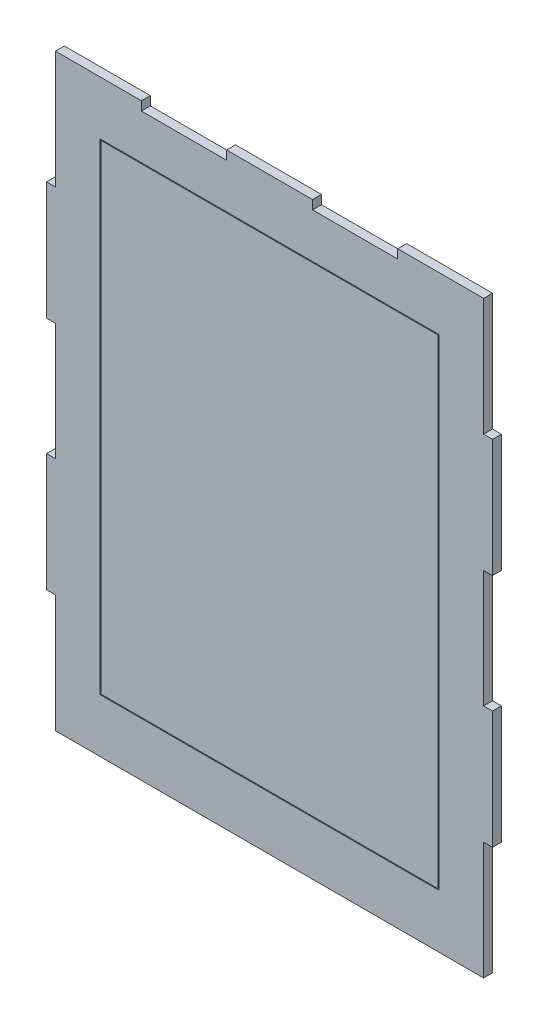
ISO-10303-21;
HEADER;
FILE_DESCRIPTION(('STEP AP214'),'2;1');
FILE_NAME('part.step','',(''),(''),'','','');
FILE_SCHEMA(('AUTOMOTIVE_DESIGN { 1 0 10303 214 1 1 1 1 }'));
ENDSEC;
DATA;
#1=APPLICATION_CONTEXT('core data for automotive mechanical design processes');
#2=APPLICATION_PROTOCOL_DEFINITION('international standard','automotive_design',2000,#1);
#3=PRODUCT_CONTEXT('',#1,'mechanical');
#4=PRODUCT('Part','Part','',(#3));
#5=PRODUCT_RELATED_PRODUCT_CATEGORY('part','',(#4));
#6=PRODUCT_DEFINITION_FORMATION('','',#4);
#7=PRODUCT_DEFINITION_CONTEXT('part definition',#1,'design');
#8=PRODUCT_DEFINITION('design','',#6,#7);
#9=PRODUCT_DEFINITION_SHAPE('','',#8);
#10=(LENGTH_UNIT() NAMED_UNIT(*) SI_UNIT(.MILLI.,.METRE.));
#11=(NAMED_UNIT(*) PLANE_ANGLE_UNIT() SI_UNIT($,.RADIAN.));
#12=(NAMED_UNIT(*) SI_UNIT($,.STERADIAN.) SOLID_ANGLE_UNIT());
#13=UNCERTAINTY_MEASURE_WITH_UNIT(LENGTH_MEASURE(1.E-05),#10,'distance_accuracy_value','');
#14=(GEOMETRIC_REPRESENTATION_CONTEXT(3) GLOBAL_UNCERTAINTY_ASSIGNED_CONTEXT((#13)) GLOBAL_UNIT_ASSIGNED_CONTEXT((#10,
#11,#12)) REPRESENTATION_CONTEXT('',''));
#15=CARTESIAN_POINT('',(0.,0.,0.));
#16=DIRECTION('',(0.,0.,1.));
#17=DIRECTION('',(1.,0.,0.));
#18=AXIS2_PLACEMENT_3D('',#15,#16,#17);
#19=CARTESIAN_POINT('',(0.,30.,5.));
#20=DIRECTION('',(0.,-1.,0.));
#21=DIRECTION('',(1.,0.,0.));
#22=AXIS2_PLACEMENT_3D('',#19,#20,#21);
#23=PLANE('',#22);
#24=DIRECTION('',(-1.,0.,0.));
#25=VECTOR('',#24,1.);
#26=CARTESIAN_POINT('',(0.,30.,0.));
#27=LINE('',#26,#25);
#28=CARTESIAN_POINT('',(220.,30.,0.));
#29=VERTEX_POINT('',#28);
#30=CARTESIAN_POINT('',(30.,30.,0.));
#31=VERTEX_POINT('',#30);
#32=EDGE_CURVE('E463',#29,#31,#27,.T.);
#33=ORIENTED_EDGE('',*,*,#32,.T.);
#34=DIRECTION('',(0.,0.,-1.));
#35=VECTOR('',#34,1.);
#36=CARTESIAN_POINT('',(30.,30.,5.));
#37=LINE('',#36,#35);
#38=CARTESIAN_POINT('',(30.,30.,5.));
#39=VERTEX_POINT('',#38);
#40=EDGE_CURVE('E13',#39,#31,#37,.T.);
#41=ORIENTED_EDGE('',*,*,#40,.F.);
#42=DIRECTION('',(-1.,0.,0.));
#43=VECTOR('',#42,1.);
#44=CARTESIAN_POINT('',(0.,30.,5.));
#45=LINE('',#44,#43);
#46=CARTESIAN_POINT('',(220.,30.,5.));
#47=VERTEX_POINT('',#46);
#48=EDGE_CURVE('E370',#47,#39,#45,.T.);
#49=ORIENTED_EDGE('',*,*,#48,.F.);
#50=DIRECTION('',(0.,0.,-1.));
#51=VECTOR('',#50,1.);
#52=CARTESIAN_POINT('',(220.,30.,5.));
#53=LINE('',#52,#51);
#54=EDGE_CURVE('E470',#47,#29,#53,.T.);
#55=ORIENTED_EDGE('',*,*,#54,.T.);
#56=EDGE_LOOP('',(#33,#41,#49,#55));
#57=FACE_BOUND('',#56,.T.);
#58=ADVANCED_FACE('F145',(#57),#23,.F.);
#59=CARTESIAN_POINT('',(30.,0.,5.));
#60=DIRECTION('',(-1.,0.,0.));
#61=DIRECTION('',(0.,-1.,0.));
#62=AXIS2_PLACEMENT_3D('',#59,#60,#61);
#63=PLANE('',#62);
#64=DIRECTION('',(0.,1.,0.));
#65=VECTOR('',#64,1.);
#66=CARTESIAN_POINT('',(30.,0.,0.));
#67=LINE('',#66,#65);
#68=CARTESIAN_POINT('',(30.,300.,0.));
#69=VERTEX_POINT('',#68);
#70=EDGE_CURVE('E375',#31,#69,#67,.T.);
#71=ORIENTED_EDGE('',*,*,#70,.T.);
#72=DIRECTION('',(0.,0.,-1.));
#73=VECTOR('',#72,1.);
#74=CARTESIAN_POINT('',(30.,300.,5.));
#75=LINE('',#74,#73);
#76=CARTESIAN_POINT('',(30.,300.,5.));
#77=VERTEX_POINT('',#76);
#78=EDGE_CURVE('E155',#77,#69,#75,.T.);
#79=ORIENTED_EDGE('',*,*,#78,.F.);
#80=DIRECTION('',(0.,1.,0.));
#81=VECTOR('',#80,1.);
#82=CARTESIAN_POINT('',(30.,0.,5.));
#83=LINE('',#82,#81);
#84=EDGE_CURVE('E364',#39,#77,#83,.T.);
#85=ORIENTED_EDGE('',*,*,#84,.F.);
#86=ORIENTED_EDGE('',*,*,#40,.T.);
#87=EDGE_LOOP('',(#71,#79,#85,#86));
#88=FACE_BOUND('',#87,.T.);
#89=ADVANCED_FACE('F374',(#88),#63,.F.);
#90=CARTESIAN_POINT('',(0.,300.,5.));
#91=DIRECTION('',(0.,1.,0.));
#92=DIRECTION('',(0.,0.,1.));
#93=AXIS2_PLACEMENT_3D('',#90,#91,#92);
#94=PLANE('',#93);
#95=DIRECTION('',(1.,0.,0.));
#96=VECTOR('',#95,1.);
#97=CARTESIAN_POINT('',(0.,300.,0.));
#98=LINE('',#97,#96);
#99=CARTESIAN_POINT('',(220.,300.,0.));
#100=VERTEX_POINT('',#99);
#101=EDGE_CURVE('E265',#69,#100,#98,.T.);
#102=ORIENTED_EDGE('',*,*,#101,.T.);
#103=DIRECTION('',(0.,0.,-1.));
#104=VECTOR('',#103,1.);
#105=CARTESIAN_POINT('',(220.,300.,5.));
#106=LINE('',#105,#104);
#107=CARTESIAN_POINT('',(220.,300.,5.));
#108=VERTEX_POINT('',#107);
#109=EDGE_CURVE('E376',#108,#100,#106,.T.);
#110=ORIENTED_EDGE('',*,*,#109,.F.);
#111=DIRECTION('',(1.,0.,0.));
#112=VECTOR('',#111,1.);
#113=CARTESIAN_POINT('',(0.,300.,5.));
#114=LINE('',#113,#112);
#115=EDGE_CURVE('E368',#77,#108,#114,.T.);
#116=ORIENTED_EDGE('',*,*,#115,.F.);
#117=ORIENTED_EDGE('',*,*,#78,.T.);
#118=EDGE_LOOP('',(#102,#110,#116,#117));
#119=FACE_BOUND('',#118,.T.);
#120=ADVANCED_FACE('F378',(#119),#94,.F.);
#121=CARTESIAN_POINT('',(196.9,0.,5.));
#122=DIRECTION('',(-1.,0.,0.));
#123=DIRECTION('',(0.,0.,1.));
#124=AXIS2_PLACEMENT_3D('',#121,#122,#123);
#125=PLANE('',#124);
#126=DIRECTION('',(0.,1.,0.));
#127=VECTOR('',#126,1.);
#128=CARTESIAN_POINT('',(196.9,0.,0.));
#129=LINE('',#128,#127);
#130=CARTESIAN_POINT('',(196.9,325.1,0.));
#131=VERTEX_POINT('',#130);
#132=CARTESIAN_POINT('',(196.9,330.1,0.));
#133=VERTEX_POINT('',#132);
#134=EDGE_CURVE('E384',#131,#133,#129,.T.);
#135=ORIENTED_EDGE('',*,*,#134,.F.);
#136=DIRECTION('',(0.,0.,-1.));
#137=VECTOR('',#136,1.);
#138=CARTESIAN_POINT('',(196.9,325.1,5.));
#139=LINE('',#138,#137);
#140=CARTESIAN_POINT('',(196.9,325.1,5.));
#141=VERTEX_POINT('',#140);
#142=EDGE_CURVE('E149',#141,#131,#139,.T.);
#143=ORIENTED_EDGE('',*,*,#142,.F.);
#144=DIRECTION('',(0.,1.,0.));
#145=VECTOR('',#144,1.);
#146=CARTESIAN_POINT('',(196.9,0.,5.));
#147=LINE('',#146,#145);
#148=CARTESIAN_POINT('',(196.9,330.1,5.));
#149=VERTEX_POINT('',#148);
#150=EDGE_CURVE('E469',#141,#149,#147,.T.);
#151=ORIENTED_EDGE('',*,*,#150,.T.);
#152=DIRECTION('',(0.,0.,-1.));
#153=VECTOR('',#152,1.);
#154=CARTESIAN_POINT('',(196.9,330.1,5.));
#155=LINE('',#154,#153);
#156=EDGE_CURVE('E380',#149,#133,#155,.T.);
#157=ORIENTED_EDGE('',*,*,#156,.T.);
#158=EDGE_LOOP('',(#135,#143,#151,#157));
#159=FACE_BOUND('',#158,.T.);
#160=ADVANCED_FACE('F147',(#159),#125,.T.);
#161=CARTESIAN_POINT('',(0.,325.1,5.));
#162=DIRECTION('',(0.,1.,0.));
#163=DIRECTION('',(0.,0.,1.));
#164=AXIS2_PLACEMENT_3D('',#161,#162,#163);
#165=PLANE('',#164);
#166=DIRECTION('',(1.,0.,0.));
#167=VECTOR('',#166,1.);
#168=CARTESIAN_POINT('',(0.,325.1,0.));
#169=LINE('',#168,#167);
#170=CARTESIAN_POINT('',(149.1,325.1,0.));
#171=VERTEX_POINT('',#170);
#172=EDGE_CURVE('E387',#171,#131,#169,.T.);
#173=ORIENTED_EDGE('',*,*,#172,.F.);
#174=DIRECTION('',(0.,0.,-1.));
#175=VECTOR('',#174,1.);
#176=CARTESIAN_POINT('',(149.1,325.1,5.));
#177=LINE('',#176,#175);
#178=CARTESIAN_POINT('',(149.1,325.1,5.));
#179=VERTEX_POINT('',#178);
#180=EDGE_CURVE('E528',#179,#171,#177,.T.);
#181=ORIENTED_EDGE('',*,*,#180,.F.);
#182=DIRECTION('',(1.,0.,0.));
#183=VECTOR('',#182,1.);
#184=CARTESIAN_POINT('',(0.,325.1,5.));
#185=LINE('',#184,#183);
#186=EDGE_CURVE('E537',#179,#141,#185,.T.);
#187=ORIENTED_EDGE('',*,*,#186,.T.);
#188=ORIENTED_EDGE('',*,*,#142,.T.);
#189=EDGE_LOOP('',(#173,#181,#187,#188));
#190=FACE_BOUND('',#189,.T.);
#191=ADVANCED_FACE('F535',(#190),#165,.T.);
#192=CARTESIAN_POINT('',(149.1,0.,5.));
#193=DIRECTION('',(1.,0.,0.));
#194=DIRECTION('',(0.,0.,-1.));
#195=AXIS2_PLACEMENT_3D('',#192,#193,#194);
#196=PLANE('',#195);
#197=DIRECTION('',(0.,-1.,0.));
#198=VECTOR('',#197,1.);
#199=CARTESIAN_POINT('',(149.1,0.,0.));
#200=LINE('',#199,#198);
#201=CARTESIAN_POINT('',(149.1,330.1,0.));
#202=VERTEX_POINT('',#201);
#203=EDGE_CURVE('E390',#202,#171,#200,.T.);
#204=ORIENTED_EDGE('',*,*,#203,.F.);
#205=DIRECTION('',(0.,0.,-1.));
#206=VECTOR('',#205,1.);
#207=CARTESIAN_POINT('',(149.1,330.1,5.));
#208=LINE('',#207,#206);
#209=CARTESIAN_POINT('',(149.1,330.1,5.));
#210=VERTEX_POINT('',#209);
#211=EDGE_CURVE('E527',#210,#202,#208,.T.);
#212=ORIENTED_EDGE('',*,*,#211,.F.);
#213=DIRECTION('',(0.,-1.,0.));
#214=VECTOR('',#213,1.);
#215=CARTESIAN_POINT('',(149.1,0.,5.));
#216=LINE('',#215,#214);
#217=EDGE_CURVE('E545',#210,#179,#216,.T.);
#218=ORIENTED_EDGE('',*,*,#217,.T.);
#219=ORIENTED_EDGE('',*,*,#180,.T.);
#220=EDGE_LOOP('',(#204,#212,#218,#219));
#221=FACE_BOUND('',#220,.T.);
#222=ADVANCED_FACE('F543',(#221),#196,.T.);
#223=CARTESIAN_POINT('',(0.,330.1,5.));
#224=DIRECTION('',(0.,1.,0.));
#225=DIRECTION('',(0.,0.,1.));
#226=AXIS2_PLACEMENT_3D('',#223,#224,#225);
#227=PLANE('',#226);
#228=DIRECTION('',(1.,0.,0.));
#229=VECTOR('',#228,1.);
#230=CARTESIAN_POINT('',(0.,330.1,0.));
#231=LINE('',#230,#229);
#232=CARTESIAN_POINT('',(100.9,330.1,0.));
#233=VERTEX_POINT('',#232);
#234=EDGE_CURVE('E393',#233,#202,#231,.T.);
#235=ORIENTED_EDGE('',*,*,#234,.F.);
#236=DIRECTION('',(0.,0.,-1.));
#237=VECTOR('',#236,1.);
#238=CARTESIAN_POINT('',(100.9,330.1,5.));
#239=LINE('',#238,#237);
#240=CARTESIAN_POINT('',(100.9,330.1,5.));
#241=VERTEX_POINT('',#240);
#242=EDGE_CURVE('E525',#241,#233,#239,.T.);
#243=ORIENTED_EDGE('',*,*,#242,.F.);
#244=DIRECTION('',(1.,0.,0.));
#245=VECTOR('',#244,1.);
#246=CARTESIAN_POINT('',(0.,330.1,5.));
#247=LINE('',#246,#245);
#248=EDGE_CURVE('E551',#241,#210,#247,.T.);
#249=ORIENTED_EDGE('',*,*,#248,.T.);
#250=ORIENTED_EDGE('',*,*,#211,.T.);
#251=EDGE_LOOP('',(#235,#243,#249,#250));
#252=FACE_BOUND('',#251,.T.);
#253=ADVANCED_FACE('F554',(#252),#227,.T.);
#254=CARTESIAN_POINT('',(100.9,0.,5.));
#255=DIRECTION('',(-1.,0.,0.));
#256=DIRECTION('',(0.,0.,1.));
#257=AXIS2_PLACEMENT_3D('',#254,#255,#256);
#258=PLANE('',#257);
#259=DIRECTION('',(0.,1.,0.));
#260=VECTOR('',#259,1.);
#261=CARTESIAN_POINT('',(100.9,0.,0.));
#262=LINE('',#261,#260);
#263=CARTESIAN_POINT('',(100.9,325.1,0.));
#264=VERTEX_POINT('',#263);
#265=EDGE_CURVE('E396',#264,#233,#262,.T.);
#266=ORIENTED_EDGE('',*,*,#265,.F.);
#267=DIRECTION('',(0.,0.,-1.));
#268=VECTOR('',#267,1.);
#269=CARTESIAN_POINT('',(100.9,325.1,5.));
#270=LINE('',#269,#268);
#271=CARTESIAN_POINT('',(100.9,325.1,5.));
#272=VERTEX_POINT('',#271);
#273=EDGE_CURVE('E523',#272,#264,#270,.T.);
#274=ORIENTED_EDGE('',*,*,#273,.F.);
#275=DIRECTION('',(0.,1.,0.));
#276=VECTOR('',#275,1.);
#277=CARTESIAN_POINT('',(100.9,0.,5.));
#278=LINE('',#277,#276);
#279=EDGE_CURVE('E555',#272,#241,#278,.T.);
#280=ORIENTED_EDGE('',*,*,#279,.T.);
#281=ORIENTED_EDGE('',*,*,#242,.T.);
#282=EDGE_LOOP('',(#266,#274,#280,#281));
#283=FACE_BOUND('',#282,.T.);
#284=ADVANCED_FACE('F721',(#283),#258,.T.);
#285=CARTESIAN_POINT('',(0.,325.1,5.));
#286=DIRECTION('',(0.,1.,0.));
#287=DIRECTION('',(0.,0.,1.));
#288=AXIS2_PLACEMENT_3D('',#285,#286,#287);
#289=PLANE('',#288);
#290=DIRECTION('',(1.,0.,0.));
#291=VECTOR('',#290,1.);
#292=CARTESIAN_POINT('',(0.,325.1,0.));
#293=LINE('',#292,#291);
#294=CARTESIAN_POINT('',(53.0999999999999,325.1,0.));
#295=VERTEX_POINT('',#294);
#296=EDGE_CURVE('E399',#295,#264,#293,.T.);
#297=ORIENTED_EDGE('',*,*,#296,.F.);
#298=DIRECTION('',(0.,0.,-1.));
#299=VECTOR('',#298,1.);
#300=CARTESIAN_POINT('',(53.0999999999999,325.1,5.));
#301=LINE('',#300,#299);
#302=CARTESIAN_POINT('',(53.0999999999999,325.1,5.));
#303=VERTEX_POINT('',#302);
#304=EDGE_CURVE('E521',#303,#295,#301,.T.);
#305=ORIENTED_EDGE('',*,*,#304,.F.);
#306=DIRECTION('',(1.,0.,0.));
#307=VECTOR('',#306,1.);
#308=CARTESIAN_POINT('',(0.,325.1,5.));
#309=LINE('',#308,#307);
#310=EDGE_CURVE('E557',#303,#272,#309,.T.);
#311=ORIENTED_EDGE('',*,*,#310,.T.);
#312=ORIENTED_EDGE('',*,*,#273,.T.);
#313=EDGE_LOOP('',(#297,#305,#311,#312));
#314=FACE_BOUND('',#313,.T.);
#315=ADVANCED_FACE('F718',(#314),#289,.T.);
#316=CARTESIAN_POINT('',(53.0999999999999,0.,5.));
#317=DIRECTION('',(1.,0.,0.));
#318=DIRECTION('',(0.,0.,-1.));
#319=AXIS2_PLACEMENT_3D('',#316,#317,#318);
#320=PLANE('',#319);
#321=DIRECTION('',(0.,-1.,0.));
#322=VECTOR('',#321,1.);
#323=CARTESIAN_POINT('',(53.0999999999999,0.,0.));
#324=LINE('',#323,#322);
#325=CARTESIAN_POINT('',(53.0999999999999,330.1,0.));
#326=VERTEX_POINT('',#325);
#327=EDGE_CURVE('E402',#326,#295,#324,.T.);
#328=ORIENTED_EDGE('',*,*,#327,.F.);
#329=DIRECTION('',(0.,0.,-1.));
#330=VECTOR('',#329,1.);
#331=CARTESIAN_POINT('',(53.0999999999999,330.1,5.));
#332=LINE('',#331,#330);
#333=CARTESIAN_POINT('',(53.0999999999999,330.1,5.));
#334=VERTEX_POINT('',#333);
#335=EDGE_CURVE('E519',#334,#326,#332,.T.);
#336=ORIENTED_EDGE('',*,*,#335,.F.);
#337=DIRECTION('',(0.,-1.,0.));
#338=VECTOR('',#337,1.);
#339=CARTESIAN_POINT('',(53.0999999999999,0.,5.));
#340=LINE('',#339,#338);
#341=EDGE_CURVE('E563',#334,#303,#340,.T.);
#342=ORIENTED_EDGE('',*,*,#341,.T.);
#343=ORIENTED_EDGE('',*,*,#304,.T.);
#344=EDGE_LOOP('',(#328,#336,#342,#343));
#345=FACE_BOUND('',#344,.T.);
#346=ADVANCED_FACE('F714',(#345),#320,.T.);
#347=CARTESIAN_POINT('',(0.,330.1,5.));
#348=DIRECTION('',(0.,1.,0.));
#349=DIRECTION('',(0.,0.,1.));
#350=AXIS2_PLACEMENT_3D('',#347,#348,#349);
#351=PLANE('',#350);
#352=DIRECTION('',(1.,0.,0.));
#353=VECTOR('',#352,1.);
#354=CARTESIAN_POINT('',(0.,330.1,0.));
#355=LINE('',#354,#353);
#356=CARTESIAN_POINT('',(4.9,330.1,0.));
#357=VERTEX_POINT('',#356);
#358=EDGE_CURVE('E405',#357,#326,#355,.T.);
#359=ORIENTED_EDGE('',*,*,#358,.F.);
#360=DIRECTION('',(0.,0.,-1.));
#361=VECTOR('',#360,1.);
#362=CARTESIAN_POINT('',(4.9,330.1,5.));
#363=LINE('',#362,#361);
#364=CARTESIAN_POINT('',(4.9,330.1,5.));
#365=VERTEX_POINT('',#364);
#366=EDGE_CURVE('E517',#365,#357,#363,.T.);
#367=ORIENTED_EDGE('',*,*,#366,.F.);
#368=DIRECTION('',(1.,0.,0.));
#369=VECTOR('',#368,1.);
#370=CARTESIAN_POINT('',(0.,330.1,5.));
#371=LINE('',#370,#369);
#372=EDGE_CURVE('E566',#365,#334,#371,.T.);
#373=ORIENTED_EDGE('',*,*,#372,.T.);
#374=ORIENTED_EDGE('',*,*,#335,.T.);
#375=EDGE_LOOP('',(#359,#367,#373,#374));
#376=FACE_BOUND('',#375,.T.);
#377=ADVANCED_FACE('F710',(#376),#351,.T.);
#378=CARTESIAN_POINT('',(4.9,0.,5.));
#379=DIRECTION('',(1.,0.,0.));
#380=DIRECTION('',(0.,0.,-1.));
#381=AXIS2_PLACEMENT_3D('',#378,#379,#380);
#382=PLANE('',#381);
#383=DIRECTION('',(0.,-1.,0.));
#384=VECTOR('',#383,1.);
#385=CARTESIAN_POINT('',(4.9,0.,0.));
#386=LINE('',#385,#384);
#387=CARTESIAN_POINT('',(4.9,264.1,0.));
#388=VERTEX_POINT('',#387);
#389=EDGE_CURVE('E408',#357,#388,#386,.T.);
#390=ORIENTED_EDGE('',*,*,#389,.T.);
#391=DIRECTION('',(0.,0.,-1.));
#392=VECTOR('',#391,1.);
#393=CARTESIAN_POINT('',(4.9,264.1,5.));
#394=LINE('',#393,#392);
#395=CARTESIAN_POINT('',(4.9,264.1,5.));
#396=VERTEX_POINT('',#395);
#397=EDGE_CURVE('E514',#396,#388,#394,.T.);
#398=ORIENTED_EDGE('',*,*,#397,.F.);
#399=DIRECTION('',(0.,-1.,0.));
#400=VECTOR('',#399,1.);
#401=CARTESIAN_POINT('',(4.9,0.,5.));
#402=LINE('',#401,#400);
#403=EDGE_CURVE('E569',#365,#396,#402,.T.);
#404=ORIENTED_EDGE('',*,*,#403,.F.);
#405=ORIENTED_EDGE('',*,*,#366,.T.);
#406=EDGE_LOOP('',(#390,#398,#404,#405));
#407=FACE_BOUND('',#406,.T.);
#408=ADVANCED_FACE('F707',(#407),#382,.F.);
#409=CARTESIAN_POINT('',(0.,264.1,5.));
#410=DIRECTION('',(0.,-1.,0.));
#411=DIRECTION('',(0.,0.,-1.));
#412=AXIS2_PLACEMENT_3D('',#409,#410,#411);
#413=PLANE('',#412);
#414=DIRECTION('',(-1.,0.,0.));
#415=VECTOR('',#414,1.);
#416=CARTESIAN_POINT('',(0.,264.1,0.));
#417=LINE('',#416,#415);
#418=CARTESIAN_POINT('',(-0.1,264.1,0.));
#419=VERTEX_POINT('',#418);
#420=EDGE_CURVE('E410',#388,#419,#417,.T.);
#421=ORIENTED_EDGE('',*,*,#420,.T.);
#422=DIRECTION('',(0.,0.,-1.));
#423=VECTOR('',#422,1.);
#424=CARTESIAN_POINT('',(-0.1,264.1,5.));
#425=LINE('',#424,#423);
#426=CARTESIAN_POINT('',(-0.1,264.1,5.));
#427=VERTEX_POINT('',#426);
#428=EDGE_CURVE('E512',#427,#419,#425,.T.);
#429=ORIENTED_EDGE('',*,*,#428,.F.);
#430=DIRECTION('',(-1.,0.,0.));
#431=VECTOR('',#430,1.);
#432=CARTESIAN_POINT('',(0.,264.1,5.));
#433=LINE('',#432,#431);
#434=EDGE_CURVE('E571',#396,#427,#433,.T.);
#435=ORIENTED_EDGE('',*,*,#434,.F.);
#436=ORIENTED_EDGE('',*,*,#397,.T.);
#437=EDGE_LOOP('',(#421,#429,#435,#436));
#438=FACE_BOUND('',#437,.T.);
#439=ADVANCED_FACE('F702',(#438),#413,.F.);
#440=CARTESIAN_POINT('',(-0.0999999999999992,0.,5.));
#441=DIRECTION('',(-1.,0.,0.));
#442=DIRECTION('',(0.,-1.,0.));
#443=AXIS2_PLACEMENT_3D('',#440,#441,#442);
#444=PLANE('',#443);
#445=DIRECTION('',(0.,1.,0.));
#446=VECTOR('',#445,1.);
#447=CARTESIAN_POINT('',(-0.0999999999999992,0.,0.));
#448=LINE('',#447,#446);
#449=CARTESIAN_POINT('',(-0.1,197.9,0.));
#450=VERTEX_POINT('',#449);
#451=EDGE_CURVE('E413',#450,#419,#448,.T.);
#452=ORIENTED_EDGE('',*,*,#451,.F.);
#453=DIRECTION('',(0.,0.,-1.));
#454=VECTOR('',#453,1.);
#455=CARTESIAN_POINT('',(-0.1,197.9,5.));
#456=LINE('',#455,#454);
#457=CARTESIAN_POINT('',(-0.1,197.9,5.));
#458=VERTEX_POINT('',#457);
#459=EDGE_CURVE('E510',#458,#450,#456,.T.);
#460=ORIENTED_EDGE('',*,*,#459,.F.);
#461=DIRECTION('',(0.,1.,0.));
#462=VECTOR('',#461,1.);
#463=CARTESIAN_POINT('',(-0.0999999999999992,0.,5.));
#464=LINE('',#463,#462);
#465=EDGE_CURVE('E573',#458,#427,#464,.T.);
#466=ORIENTED_EDGE('',*,*,#465,.T.);
#467=ORIENTED_EDGE('',*,*,#428,.T.);
#468=EDGE_LOOP('',(#452,#460,#466,#467));
#469=FACE_BOUND('',#468,.T.);
#470=ADVANCED_FACE('F696',(#469),#444,.T.);
#471=CARTESIAN_POINT('',(0.,197.9,5.));
#472=DIRECTION('',(0.,-1.,0.));
#473=DIRECTION('',(0.,0.,-1.));
#474=AXIS2_PLACEMENT_3D('',#471,#472,#473);
#475=PLANE('',#474);
#476=DIRECTION('',(-1.,0.,0.));
#477=VECTOR('',#476,1.);
#478=CARTESIAN_POINT('',(0.,197.9,0.));
#479=LINE('',#478,#477);
#480=CARTESIAN_POINT('',(4.9,197.9,0.));
#481=VERTEX_POINT('',#480);
#482=EDGE_CURVE('E416',#481,#450,#479,.T.);
#483=ORIENTED_EDGE('',*,*,#482,.F.);
#484=DIRECTION('',(0.,0.,-1.));
#485=VECTOR('',#484,1.);
#486=CARTESIAN_POINT('',(4.9,197.9,5.));
#487=LINE('',#486,#485);
#488=CARTESIAN_POINT('',(4.9,197.9,5.));
#489=VERTEX_POINT('',#488);
#490=EDGE_CURVE('E508',#489,#481,#487,.T.);
#491=ORIENTED_EDGE('',*,*,#490,.F.);
#492=DIRECTION('',(-1.,0.,0.));
#493=VECTOR('',#492,1.);
#494=CARTESIAN_POINT('',(0.,197.9,5.));
#495=LINE('',#494,#493);
#496=EDGE_CURVE('E576',#489,#458,#495,.T.);
#497=ORIENTED_EDGE('',*,*,#496,.T.);
#498=ORIENTED_EDGE('',*,*,#459,.T.);
#499=EDGE_LOOP('',(#483,#491,#497,#498));
#500=FACE_BOUND('',#499,.T.);
#501=ADVANCED_FACE('F692',(#500),#475,.T.);
#502=CARTESIAN_POINT('',(4.9,0.,5.));
#503=DIRECTION('',(-1.,0.,0.));
#504=DIRECTION('',(0.,0.,1.));
#505=AXIS2_PLACEMENT_3D('',#502,#503,#504);
#506=PLANE('',#505);
#507=DIRECTION('',(0.,1.,0.));
#508=VECTOR('',#507,1.);
#509=CARTESIAN_POINT('',(4.9,0.,0.));
#510=LINE('',#509,#508);
#511=CARTESIAN_POINT('',(4.9,132.1,0.));
#512=VERTEX_POINT('',#511);
#513=EDGE_CURVE('E419',#512,#481,#510,.T.);
#514=ORIENTED_EDGE('',*,*,#513,.F.);
#515=DIRECTION('',(0.,0.,-1.));
#516=VECTOR('',#515,1.);
#517=CARTESIAN_POINT('',(4.9,132.1,5.));
#518=LINE('',#517,#516);
#519=CARTESIAN_POINT('',(4.9,132.1,5.));
#520=VERTEX_POINT('',#519);
#521=EDGE_CURVE('E506',#520,#512,#518,.T.);
#522=ORIENTED_EDGE('',*,*,#521,.F.);
#523=DIRECTION('',(0.,1.,0.));
#524=VECTOR('',#523,1.);
#525=CARTESIAN_POINT('',(4.9,0.,5.));
#526=LINE('',#525,#524);
#527=EDGE_CURVE('E579',#520,#489,#526,.T.);
#528=ORIENTED_EDGE('',*,*,#527,.T.);
#529=ORIENTED_EDGE('',*,*,#490,.T.);
#530=EDGE_LOOP('',(#514,#522,#528,#529));
#531=FACE_BOUND('',#530,.T.);
#532=ADVANCED_FACE('F688',(#531),#506,.T.);
#533=CARTESIAN_POINT('',(0.,132.1,5.));
#534=DIRECTION('',(0.,1.,0.));
#535=DIRECTION('',(0.,0.,1.));
#536=AXIS2_PLACEMENT_3D('',#533,#534,#535);
#537=PLANE('',#536);
#538=DIRECTION('',(1.,0.,0.));
#539=VECTOR('',#538,1.);
#540=CARTESIAN_POINT('',(0.,132.1,0.));
#541=LINE('',#540,#539);
#542=CARTESIAN_POINT('',(-0.1,132.1,0.));
#543=VERTEX_POINT('',#542);
#544=EDGE_CURVE('E422',#543,#512,#541,.T.);
#545=ORIENTED_EDGE('',*,*,#544,.F.);
#546=DIRECTION('',(0.,0.,-1.));
#547=VECTOR('',#546,1.);
#548=CARTESIAN_POINT('',(-0.1,132.1,5.));
#549=LINE('',#548,#547);
#550=CARTESIAN_POINT('',(-0.1,132.1,5.));
#551=VERTEX_POINT('',#550);
#552=EDGE_CURVE('E504',#551,#543,#549,.T.);
#553=ORIENTED_EDGE('',*,*,#552,.F.);
#554=DIRECTION('',(1.,0.,0.));
#555=VECTOR('',#554,1.);
#556=CARTESIAN_POINT('',(0.,132.1,5.));
#557=LINE('',#556,#555);
#558=EDGE_CURVE('E582',#551,#520,#557,.T.);
#559=ORIENTED_EDGE('',*,*,#558,.T.);
#560=ORIENTED_EDGE('',*,*,#521,.T.);
#561=EDGE_LOOP('',(#545,#553,#559,#560));
#562=FACE_BOUND('',#561,.T.);
#563=ADVANCED_FACE('F684',(#562),#537,.T.);
#564=CARTESIAN_POINT('',(-0.1,0.,5.));
#565=DIRECTION('',(-1.,0.,0.));
#566=DIRECTION('',(0.,0.,1.));
#567=AXIS2_PLACEMENT_3D('',#564,#565,#566);
#568=PLANE('',#567);
#569=DIRECTION('',(0.,1.,0.));
#570=VECTOR('',#569,1.);
#571=CARTESIAN_POINT('',(-0.1,0.,0.));
#572=LINE('',#571,#570);
#573=CARTESIAN_POINT('',(-0.1,65.9,0.));
#574=VERTEX_POINT('',#573);
#575=EDGE_CURVE('E425',#574,#543,#572,.T.);
#576=ORIENTED_EDGE('',*,*,#575,.F.);
#577=DIRECTION('',(0.,0.,-1.));
#578=VECTOR('',#577,1.);
#579=CARTESIAN_POINT('',(-0.1,65.9,5.));
#580=LINE('',#579,#578);
#581=CARTESIAN_POINT('',(-0.1,65.9,5.));
#582=VERTEX_POINT('',#581);
#583=EDGE_CURVE('E502',#582,#574,#580,.T.);
#584=ORIENTED_EDGE('',*,*,#583,.F.);
#585=DIRECTION('',(0.,1.,0.));
#586=VECTOR('',#585,1.);
#587=CARTESIAN_POINT('',(-0.1,0.,5.));
#588=LINE('',#587,#586);
#589=EDGE_CURVE('E585',#582,#551,#588,.T.);
#590=ORIENTED_EDGE('',*,*,#589,.T.);
#591=ORIENTED_EDGE('',*,*,#552,.T.);
#592=EDGE_LOOP('',(#576,#584,#590,#591));
#593=FACE_BOUND('',#592,.T.);
#594=ADVANCED_FACE('F680',(#593),#568,.T.);
#595=CARTESIAN_POINT('',(0.,65.9,5.));
#596=DIRECTION('',(0.,1.,0.));
#597=DIRECTION('',(0.,0.,1.));
#598=AXIS2_PLACEMENT_3D('',#595,#596,#597);
#599=PLANE('',#598);
#600=DIRECTION('',(1.,0.,0.));
#601=VECTOR('',#600,1.);
#602=CARTESIAN_POINT('',(0.,65.9,0.));
#603=LINE('',#602,#601);
#604=CARTESIAN_POINT('',(4.9,65.9,0.));
#605=VERTEX_POINT('',#604);
#606=EDGE_CURVE('E428',#574,#605,#603,.T.);
#607=ORIENTED_EDGE('',*,*,#606,.T.);
#608=DIRECTION('',(0.,0.,-1.));
#609=VECTOR('',#608,1.);
#610=CARTESIAN_POINT('',(4.9,65.9,5.));
#611=LINE('',#610,#609);
#612=CARTESIAN_POINT('',(4.9,65.9,5.));
#613=VERTEX_POINT('',#612);
#614=EDGE_CURVE('E499',#613,#605,#611,.T.);
#615=ORIENTED_EDGE('',*,*,#614,.F.);
#616=DIRECTION('',(1.,0.,0.));
#617=VECTOR('',#616,1.);
#618=CARTESIAN_POINT('',(0.,65.9,5.));
#619=LINE('',#618,#617);
#620=EDGE_CURVE('E588',#582,#613,#619,.T.);
#621=ORIENTED_EDGE('',*,*,#620,.F.);
#622=ORIENTED_EDGE('',*,*,#583,.T.);
#623=EDGE_LOOP('',(#607,#615,#621,#622));
#624=FACE_BOUND('',#623,.T.);
#625=ADVANCED_FACE('F676',(#624),#599,.F.);
#626=CARTESIAN_POINT('',(4.9,0.,5.));
#627=DIRECTION('',(1.,0.,0.));
#628=DIRECTION('',(0.,0.,-1.));
#629=AXIS2_PLACEMENT_3D('',#626,#627,#628);
#630=PLANE('',#629);
#631=DIRECTION('',(0.,-1.,0.));
#632=VECTOR('',#631,1.);
#633=CARTESIAN_POINT('',(4.9,0.,0.));
#634=LINE('',#633,#632);
#635=CARTESIAN_POINT('',(4.9,-0.100000000000003,0.));
#636=VERTEX_POINT('',#635);
#637=EDGE_CURVE('E430',#605,#636,#634,.T.);
#638=ORIENTED_EDGE('',*,*,#637,.T.);
#639=DIRECTION('',(0.,0.,-1.));
#640=VECTOR('',#639,1.);
#641=CARTESIAN_POINT('',(4.9,-0.100000000000003,5.));
#642=LINE('',#641,#640);
#643=CARTESIAN_POINT('',(4.9,-0.100000000000003,5.));
#644=VERTEX_POINT('',#643);
#645=EDGE_CURVE('E496',#644,#636,#642,.T.);
#646=ORIENTED_EDGE('',*,*,#645,.F.);
#647=DIRECTION('',(0.,-1.,0.));
#648=VECTOR('',#647,1.);
#649=CARTESIAN_POINT('',(4.9,0.,5.));
#650=LINE('',#649,#648);
#651=EDGE_CURVE('E590',#613,#644,#650,.T.);
#652=ORIENTED_EDGE('',*,*,#651,.F.);
#653=ORIENTED_EDGE('',*,*,#614,.T.);
#654=EDGE_LOOP('',(#638,#646,#652,#653));
#655=FACE_BOUND('',#654,.T.);
#656=ADVANCED_FACE('F672',(#655),#630,.F.);
#657=CARTESIAN_POINT('',(0.,-0.100000000000003,5.));
#658=DIRECTION('',(0.,1.,0.));
#659=DIRECTION('',(-1.,0.,0.));
#660=AXIS2_PLACEMENT_3D('',#657,#658,#659);
#661=PLANE('',#660);
#662=DIRECTION('',(1.,0.,0.));
#663=VECTOR('',#662,1.);
#664=CARTESIAN_POINT('',(0.,-0.100000000000003,0.));
#665=LINE('',#664,#663);
#666=CARTESIAN_POINT('',(245.1,-0.1,0.));
#667=VERTEX_POINT('',#666);
#668=EDGE_CURVE('E432',#636,#667,#665,.T.);
#669=ORIENTED_EDGE('',*,*,#668,.T.);
#670=DIRECTION('',(0.,0.,-1.));
#671=VECTOR('',#670,1.);
#672=CARTESIAN_POINT('',(245.1,-0.1,5.));
#673=LINE('',#672,#671);
#674=CARTESIAN_POINT('',(245.1,-0.1,5.));
#675=VERTEX_POINT('',#674);
#676=EDGE_CURVE('E494',#675,#667,#673,.T.);
#677=ORIENTED_EDGE('',*,*,#676,.F.);
#678=DIRECTION('',(1.,0.,0.));
#679=VECTOR('',#678,1.);
#680=CARTESIAN_POINT('',(0.,-0.100000000000003,5.));
#681=LINE('',#680,#679);
#682=EDGE_CURVE('E592',#644,#675,#681,.T.);
#683=ORIENTED_EDGE('',*,*,#682,.F.);
#684=ORIENTED_EDGE('',*,*,#645,.T.);
#685=EDGE_LOOP('',(#669,#677,#683,#684));
#686=FACE_BOUND('',#685,.T.);
#687=ADVANCED_FACE('F667',(#686),#661,.F.);
#688=CARTESIAN_POINT('',(245.1,0.,5.));
#689=DIRECTION('',(1.,0.,0.));
#690=DIRECTION('',(0.,0.,-1.));
#691=AXIS2_PLACEMENT_3D('',#688,#689,#690);
#692=PLANE('',#691);
#693=DIRECTION('',(0.,-1.,0.));
#694=VECTOR('',#693,1.);
#695=CARTESIAN_POINT('',(245.1,0.,0.));
#696=LINE('',#695,#694);
#697=CARTESIAN_POINT('',(245.1,65.9,0.));
#698=VERTEX_POINT('',#697);
#699=EDGE_CURVE('E435',#698,#667,#696,.T.);
#700=ORIENTED_EDGE('',*,*,#699,.F.);
#701=DIRECTION('',(0.,0.,-1.));
#702=VECTOR('',#701,1.);
#703=CARTESIAN_POINT('',(245.1,65.9,5.));
#704=LINE('',#703,#702);
#705=CARTESIAN_POINT('',(245.1,65.9,5.));
#706=VERTEX_POINT('',#705);
#707=EDGE_CURVE('E492',#706,#698,#704,.T.);
#708=ORIENTED_EDGE('',*,*,#707,.F.);
#709=DIRECTION('',(0.,-1.,0.));
#710=VECTOR('',#709,1.);
#711=CARTESIAN_POINT('',(245.1,0.,5.));
#712=LINE('',#711,#710);
#713=EDGE_CURVE('E594',#706,#675,#712,.T.);
#714=ORIENTED_EDGE('',*,*,#713,.T.);
#715=ORIENTED_EDGE('',*,*,#676,.T.);
#716=EDGE_LOOP('',(#700,#708,#714,#715));
#717=FACE_BOUND('',#716,.T.);
#718=ADVANCED_FACE('F661',(#717),#692,.T.);
#719=CARTESIAN_POINT('',(0.,65.9,5.));
#720=DIRECTION('',(0.,-1.,0.));
#721=DIRECTION('',(0.,0.,-1.));
#722=AXIS2_PLACEMENT_3D('',#719,#720,#721);
#723=PLANE('',#722);
#724=DIRECTION('',(-1.,0.,0.));
#725=VECTOR('',#724,1.);
#726=CARTESIAN_POINT('',(0.,65.9,0.));
#727=LINE('',#726,#725);
#728=CARTESIAN_POINT('',(250.1,65.9,0.));
#729=VERTEX_POINT('',#728);
#730=EDGE_CURVE('E438',#729,#698,#727,.T.);
#731=ORIENTED_EDGE('',*,*,#730,.F.);
#732=DIRECTION('',(0.,0.,-1.));
#733=VECTOR('',#732,1.);
#734=CARTESIAN_POINT('',(250.1,65.9,5.));
#735=LINE('',#734,#733);
#736=CARTESIAN_POINT('',(250.1,65.9,5.));
#737=VERTEX_POINT('',#736);
#738=EDGE_CURVE('E490',#737,#729,#735,.T.);
#739=ORIENTED_EDGE('',*,*,#738,.F.);
#740=DIRECTION('',(-1.,0.,0.));
#741=VECTOR('',#740,1.);
#742=CARTESIAN_POINT('',(0.,65.9,5.));
#743=LINE('',#742,#741);
#744=EDGE_CURVE('E597',#737,#706,#743,.T.);
#745=ORIENTED_EDGE('',*,*,#744,.T.);
#746=ORIENTED_EDGE('',*,*,#707,.T.);
#747=EDGE_LOOP('',(#731,#739,#745,#746));
#748=FACE_BOUND('',#747,.T.);
#749=ADVANCED_FACE('F656',(#748),#723,.T.);
#750=CARTESIAN_POINT('',(250.1,0.,5.));
#751=DIRECTION('',(-1.,0.,0.));
#752=DIRECTION('',(0.,0.,1.));
#753=AXIS2_PLACEMENT_3D('',#750,#751,#752);
#754=PLANE('',#753);
#755=DIRECTION('',(0.,1.,0.));
#756=VECTOR('',#755,1.);
#757=CARTESIAN_POINT('',(250.1,0.,0.));
#758=LINE('',#757,#756);
#759=CARTESIAN_POINT('',(250.1,132.1,0.));
#760=VERTEX_POINT('',#759);
#761=EDGE_CURVE('E441',#729,#760,#758,.T.);
#762=ORIENTED_EDGE('',*,*,#761,.T.);
#763=DIRECTION('',(0.,0.,-1.));
#764=VECTOR('',#763,1.);
#765=CARTESIAN_POINT('',(250.1,132.1,5.));
#766=LINE('',#765,#764);
#767=CARTESIAN_POINT('',(250.1,132.1,5.));
#768=VERTEX_POINT('',#767);
#769=EDGE_CURVE('E488',#768,#760,#766,.T.);
#770=ORIENTED_EDGE('',*,*,#769,.F.);
#771=DIRECTION('',(0.,1.,0.));
#772=VECTOR('',#771,1.);
#773=CARTESIAN_POINT('',(250.1,0.,5.));
#774=LINE('',#773,#772);
#775=EDGE_CURVE('E600',#737,#768,#774,.T.);
#776=ORIENTED_EDGE('',*,*,#775,.F.);
#777=ORIENTED_EDGE('',*,*,#738,.T.);
#778=EDGE_LOOP('',(#762,#770,#776,#777));
#779=FACE_BOUND('',#778,.T.);
#780=ADVANCED_FACE('F653',(#779),#754,.F.);
#781=CARTESIAN_POINT('',(0.,132.1,5.));
#782=DIRECTION('',(0.,1.,0.));
#783=DIRECTION('',(0.,0.,1.));
#784=AXIS2_PLACEMENT_3D('',#781,#782,#783);
#785=PLANE('',#784);
#786=DIRECTION('',(1.,0.,0.));
#787=VECTOR('',#786,1.);
#788=CARTESIAN_POINT('',(0.,132.1,0.));
#789=LINE('',#788,#787);
#790=CARTESIAN_POINT('',(245.1,132.1,0.));
#791=VERTEX_POINT('',#790);
#792=EDGE_CURVE('E444',#791,#760,#789,.T.);
#793=ORIENTED_EDGE('',*,*,#792,.F.);
#794=DIRECTION('',(0.,0.,-1.));
#795=VECTOR('',#794,1.);
#796=CARTESIAN_POINT('',(245.1,132.1,5.));
#797=LINE('',#796,#795);
#798=CARTESIAN_POINT('',(245.1,132.1,5.));
#799=VERTEX_POINT('',#798);
#800=EDGE_CURVE('E486',#799,#791,#797,.T.);
#801=ORIENTED_EDGE('',*,*,#800,.F.);
#802=DIRECTION('',(1.,0.,0.));
#803=VECTOR('',#802,1.);
#804=CARTESIAN_POINT('',(0.,132.1,5.));
#805=LINE('',#804,#803);
#806=EDGE_CURVE('E602',#799,#768,#805,.T.);
#807=ORIENTED_EDGE('',*,*,#806,.T.);
#808=ORIENTED_EDGE('',*,*,#769,.T.);
#809=EDGE_LOOP('',(#793,#801,#807,#808));
#810=FACE_BOUND('',#809,.T.);
#811=ADVANCED_FACE('F649',(#810),#785,.T.);
#812=CARTESIAN_POINT('',(245.1,0.,5.));
#813=DIRECTION('',(1.,0.,0.));
#814=DIRECTION('',(0.,0.,-1.));
#815=AXIS2_PLACEMENT_3D('',#812,#813,#814);
#816=PLANE('',#815);
#817=DIRECTION('',(0.,-1.,0.));
#818=VECTOR('',#817,1.);
#819=CARTESIAN_POINT('',(245.1,0.,0.));
#820=LINE('',#819,#818);
#821=CARTESIAN_POINT('',(245.1,197.9,0.));
#822=VERTEX_POINT('',#821);
#823=EDGE_CURVE('E447',#822,#791,#820,.T.);
#824=ORIENTED_EDGE('',*,*,#823,.F.);
#825=DIRECTION('',(0.,0.,-1.));
#826=VECTOR('',#825,1.);
#827=CARTESIAN_POINT('',(245.1,197.9,5.));
#828=LINE('',#827,#826);
#829=CARTESIAN_POINT('',(245.1,197.9,5.));
#830=VERTEX_POINT('',#829);
#831=EDGE_CURVE('E484',#830,#822,#828,.T.);
#832=ORIENTED_EDGE('',*,*,#831,.F.);
#833=DIRECTION('',(0.,-1.,0.));
#834=VECTOR('',#833,1.);
#835=CARTESIAN_POINT('',(245.1,0.,5.));
#836=LINE('',#835,#834);
#837=EDGE_CURVE('E605',#830,#799,#836,.T.);
#838=ORIENTED_EDGE('',*,*,#837,.T.);
#839=ORIENTED_EDGE('',*,*,#800,.T.);
#840=EDGE_LOOP('',(#824,#832,#838,#839));
#841=FACE_BOUND('',#840,.T.);
#842=ADVANCED_FACE('F645',(#841),#816,.T.);
#843=CARTESIAN_POINT('',(0.,197.9,5.));
#844=DIRECTION('',(0.,-1.,0.));
#845=DIRECTION('',(0.,0.,-1.));
#846=AXIS2_PLACEMENT_3D('',#843,#844,#845);
#847=PLANE('',#846);
#848=DIRECTION('',(-1.,0.,0.));
#849=VECTOR('',#848,1.);
#850=CARTESIAN_POINT('',(0.,197.9,0.));
#851=LINE('',#850,#849);
#852=CARTESIAN_POINT('',(250.1,197.9,0.));
#853=VERTEX_POINT('',#852);
#854=EDGE_CURVE('E450',#853,#822,#851,.T.);
#855=ORIENTED_EDGE('',*,*,#854,.F.);
#856=DIRECTION('',(0.,0.,-1.));
#857=VECTOR('',#856,1.);
#858=CARTESIAN_POINT('',(250.1,197.9,5.));
#859=LINE('',#858,#857);
#860=CARTESIAN_POINT('',(250.1,197.9,5.));
#861=VERTEX_POINT('',#860);
#862=EDGE_CURVE('E482',#861,#853,#859,.T.);
#863=ORIENTED_EDGE('',*,*,#862,.F.);
#864=DIRECTION('',(-1.,0.,0.));
#865=VECTOR('',#864,1.);
#866=CARTESIAN_POINT('',(0.,197.9,5.));
#867=LINE('',#866,#865);
#868=EDGE_CURVE('E608',#861,#830,#867,.T.);
#869=ORIENTED_EDGE('',*,*,#868,.T.);
#870=ORIENTED_EDGE('',*,*,#831,.T.);
#871=EDGE_LOOP('',(#855,#863,#869,#870));
#872=FACE_BOUND('',#871,.T.);
#873=ADVANCED_FACE('F640',(#872),#847,.T.);
#874=CARTESIAN_POINT('',(250.1,0.,5.));
#875=DIRECTION('',(-1.,0.,0.));
#876=DIRECTION('',(0.,0.,1.));
#877=AXIS2_PLACEMENT_3D('',#874,#875,#876);
#878=PLANE('',#877);
#879=DIRECTION('',(0.,1.,0.));
#880=VECTOR('',#879,1.);
#881=CARTESIAN_POINT('',(250.1,0.,0.));
#882=LINE('',#881,#880);
#883=CARTESIAN_POINT('',(250.1,264.1,0.));
#884=VERTEX_POINT('',#883);
#885=EDGE_CURVE('E453',#853,#884,#882,.T.);
#886=ORIENTED_EDGE('',*,*,#885,.T.);
#887=DIRECTION('',(0.,0.,-1.));
#888=VECTOR('',#887,1.);
#889=CARTESIAN_POINT('',(250.1,264.1,5.));
#890=LINE('',#889,#888);
#891=CARTESIAN_POINT('',(250.1,264.1,5.));
#892=VERTEX_POINT('',#891);
#893=EDGE_CURVE('E479',#892,#884,#890,.T.);
#894=ORIENTED_EDGE('',*,*,#893,.F.);
#895=DIRECTION('',(0.,1.,0.));
#896=VECTOR('',#895,1.);
#897=CARTESIAN_POINT('',(250.1,0.,5.));
#898=LINE('',#897,#896);
#899=EDGE_CURVE('E611',#861,#892,#898,.T.);
#900=ORIENTED_EDGE('',*,*,#899,.F.);
#901=ORIENTED_EDGE('',*,*,#862,.T.);
#902=EDGE_LOOP('',(#886,#894,#900,#901));
#903=FACE_BOUND('',#902,.T.);
#904=ADVANCED_FACE('F637',(#903),#878,.F.);
#905=CARTESIAN_POINT('',(0.,264.1,5.));
#906=DIRECTION('',(0.,-1.,0.));
#907=DIRECTION('',(0.,0.,-1.));
#908=AXIS2_PLACEMENT_3D('',#905,#906,#907);
#909=PLANE('',#908);
#910=DIRECTION('',(-1.,0.,0.));
#911=VECTOR('',#910,1.);
#912=CARTESIAN_POINT('',(0.,264.1,0.));
#913=LINE('',#912,#911);
#914=CARTESIAN_POINT('',(245.1,264.1,0.));
#915=VERTEX_POINT('',#914);
#916=EDGE_CURVE('E455',#884,#915,#913,.T.);
#917=ORIENTED_EDGE('',*,*,#916,.T.);
#918=DIRECTION('',(0.,0.,-1.));
#919=VECTOR('',#918,1.);
#920=CARTESIAN_POINT('',(245.1,264.1,5.));
#921=LINE('',#920,#919);
#922=CARTESIAN_POINT('',(245.1,264.1,5.));
#923=VERTEX_POINT('',#922);
#924=EDGE_CURVE('E476',#923,#915,#921,.T.);
#925=ORIENTED_EDGE('',*,*,#924,.F.);
#926=DIRECTION('',(-1.,0.,0.));
#927=VECTOR('',#926,1.);
#928=CARTESIAN_POINT('',(0.,264.1,5.));
#929=LINE('',#928,#927);
#930=EDGE_CURVE('E613',#892,#923,#929,.T.);
#931=ORIENTED_EDGE('',*,*,#930,.F.);
#932=ORIENTED_EDGE('',*,*,#893,.T.);
#933=EDGE_LOOP('',(#917,#925,#931,#932));
#934=FACE_BOUND('',#933,.T.);
#935=ADVANCED_FACE('F633',(#934),#909,.F.);
#936=CARTESIAN_POINT('',(245.1,0.,5.));
#937=DIRECTION('',(-1.,0.,0.));
#938=DIRECTION('',(0.,0.,1.));
#939=AXIS2_PLACEMENT_3D('',#936,#937,#938);
#940=PLANE('',#939);
#941=DIRECTION('',(0.,1.,0.));
#942=VECTOR('',#941,1.);
#943=CARTESIAN_POINT('',(245.1,0.,0.));
#944=LINE('',#943,#942);
#945=CARTESIAN_POINT('',(245.1,330.1,0.));
#946=VERTEX_POINT('',#945);
#947=EDGE_CURVE('E457',#915,#946,#944,.T.);
#948=ORIENTED_EDGE('',*,*,#947,.T.);
#949=DIRECTION('',(0.,0.,-1.));
#950=VECTOR('',#949,1.);
#951=CARTESIAN_POINT('',(245.1,330.1,5.));
#952=LINE('',#951,#950);
#953=CARTESIAN_POINT('',(245.1,330.1,5.));
#954=VERTEX_POINT('',#953);
#955=EDGE_CURVE('E474',#954,#946,#952,.T.);
#956=ORIENTED_EDGE('',*,*,#955,.F.);
#957=DIRECTION('',(0.,1.,0.));
#958=VECTOR('',#957,1.);
#959=CARTESIAN_POINT('',(245.1,0.,5.));
#960=LINE('',#959,#958);
#961=EDGE_CURVE('E615',#923,#954,#960,.T.);
#962=ORIENTED_EDGE('',*,*,#961,.F.);
#963=ORIENTED_EDGE('',*,*,#924,.T.);
#964=EDGE_LOOP('',(#948,#956,#962,#963));
#965=FACE_BOUND('',#964,.T.);
#966=ADVANCED_FACE('F627',(#965),#940,.F.);
#967=CARTESIAN_POINT('',(0.,330.1,5.));
#968=DIRECTION('',(0.,1.,0.));
#969=DIRECTION('',(0.,0.,1.));
#970=AXIS2_PLACEMENT_3D('',#967,#968,#969);
#971=PLANE('',#970);
#972=DIRECTION('',(1.,0.,0.));
#973=VECTOR('',#972,1.);
#974=CARTESIAN_POINT('',(0.,330.1,0.));
#975=LINE('',#974,#973);
#976=EDGE_CURVE('E460',#133,#946,#975,.T.);
#977=ORIENTED_EDGE('',*,*,#976,.F.);
#978=ORIENTED_EDGE('',*,*,#156,.F.);
#979=DIRECTION('',(1.,0.,0.));
#980=VECTOR('',#979,1.);
#981=CARTESIAN_POINT('',(0.,330.1,5.));
#982=LINE('',#981,#980);
#983=EDGE_CURVE('E617',#149,#954,#982,.T.);
#984=ORIENTED_EDGE('',*,*,#983,.T.);
#985=ORIENTED_EDGE('',*,*,#955,.T.);
#986=EDGE_LOOP('',(#977,#978,#984,#985));
#987=FACE_BOUND('',#986,.T.);
#988=ADVANCED_FACE('F621',(#987),#971,.T.);
#989=CARTESIAN_POINT('',(220.,0.,5.));
#990=DIRECTION('',(1.,0.,0.));
#991=DIRECTION('',(0.,0.,-1.));
#992=AXIS2_PLACEMENT_3D('',#989,#990,#991);
#993=PLANE('',#992);
#994=DIRECTION('',(0.,-1.,0.));
#995=VECTOR('',#994,1.);
#996=CARTESIAN_POINT('',(220.,0.,0.));
#997=LINE('',#996,#995);
#998=EDGE_CURVE('E271',#100,#29,#997,.T.);
#999=ORIENTED_EDGE('',*,*,#998,.T.);
#1000=ORIENTED_EDGE('',*,*,#54,.F.);
#1001=DIRECTION('',(0.,-1.,0.));
#1002=VECTOR('',#1001,1.);
#1003=CARTESIAN_POINT('',(220.,0.,5.));
#1004=LINE('',#1003,#1002);
#1005=EDGE_CURVE('E164',#108,#47,#1004,.T.);
#1006=ORIENTED_EDGE('',*,*,#1005,.F.);
#1007=ORIENTED_EDGE('',*,*,#109,.T.);
#1008=EDGE_LOOP('',(#999,#1000,#1006,#1007));
#1009=FACE_BOUND('',#1008,.T.);
#1010=ADVANCED_FACE('F741',(#1009),#993,.F.);
#1011=CARTESIAN_POINT('',(0.,0.,5.));
#1012=DIRECTION('',(0.,0.,1.));
#1013=DIRECTION('',(1.,0.,0.));
#1014=AXIS2_PLACEMENT_3D('',#1011,#1012,#1013);
#1015=PLANE('',#1014);
#1016=ORIENTED_EDGE('',*,*,#150,.F.);
#1017=ORIENTED_EDGE('',*,*,#186,.F.);
#1018=ORIENTED_EDGE('',*,*,#217,.F.);
#1019=ORIENTED_EDGE('',*,*,#248,.F.);
#1020=ORIENTED_EDGE('',*,*,#279,.F.);
#1021=ORIENTED_EDGE('',*,*,#310,.F.);
#1022=ORIENTED_EDGE('',*,*,#341,.F.);
#1023=ORIENTED_EDGE('',*,*,#372,.F.);
#1024=ORIENTED_EDGE('',*,*,#403,.T.);
#1025=ORIENTED_EDGE('',*,*,#434,.T.);
#1026=ORIENTED_EDGE('',*,*,#465,.F.);
#1027=ORIENTED_EDGE('',*,*,#496,.F.);
#1028=ORIENTED_EDGE('',*,*,#527,.F.);
#1029=ORIENTED_EDGE('',*,*,#558,.F.);
#1030=ORIENTED_EDGE('',*,*,#589,.F.);
#1031=ORIENTED_EDGE('',*,*,#620,.T.);
#1032=ORIENTED_EDGE('',*,*,#651,.T.);
#1033=ORIENTED_EDGE('',*,*,#682,.T.);
#1034=ORIENTED_EDGE('',*,*,#713,.F.);
#1035=ORIENTED_EDGE('',*,*,#744,.F.);
#1036=ORIENTED_EDGE('',*,*,#775,.T.);
#1037=ORIENTED_EDGE('',*,*,#806,.F.);
#1038=ORIENTED_EDGE('',*,*,#837,.F.);
#1039=ORIENTED_EDGE('',*,*,#868,.F.);
#1040=ORIENTED_EDGE('',*,*,#899,.T.);
#1041=ORIENTED_EDGE('',*,*,#930,.T.);
#1042=ORIENTED_EDGE('',*,*,#961,.T.);
#1043=ORIENTED_EDGE('',*,*,#983,.F.);
#1044=EDGE_LOOP('',(#1016,#1017,#1018,#1019,#1020,#1021,#1022,#1023,#1024,#1025,#1026,#1027,
#1028,#1029,#1030,#1031,#1032,#1033,#1034,#1035,#1036,#1037,#1038,#1039,#1040,#1041,#1042,#1043));
#1045=FACE_BOUND('',#1044,.T.);
#1046=ORIENTED_EDGE('',*,*,#48,.T.);
#1047=ORIENTED_EDGE('',*,*,#84,.T.);
#1048=ORIENTED_EDGE('',*,*,#115,.T.);
#1049=ORIENTED_EDGE('',*,*,#1005,.T.);
#1050=EDGE_LOOP('',(#1046,#1047,#1048,#1049));
#1051=FACE_BOUND('',#1050,.T.);
#1052=ADVANCED_FACE('F366',(#1045,#1051),#1015,.T.);
#1053=CARTESIAN_POINT('',(0.,0.,0.));
#1054=DIRECTION('',(0.,0.,1.));
#1055=DIRECTION('',(1.,0.,0.));
#1056=AXIS2_PLACEMENT_3D('',#1053,#1054,#1055);
#1057=PLANE('',#1056);
#1058=ORIENTED_EDGE('',*,*,#134,.T.);
#1059=ORIENTED_EDGE('',*,*,#976,.T.);
#1060=ORIENTED_EDGE('',*,*,#947,.F.);
#1061=ORIENTED_EDGE('',*,*,#916,.F.);
#1062=ORIENTED_EDGE('',*,*,#885,.F.);
#1063=ORIENTED_EDGE('',*,*,#854,.T.);
#1064=ORIENTED_EDGE('',*,*,#823,.T.);
#1065=ORIENTED_EDGE('',*,*,#792,.T.);
#1066=ORIENTED_EDGE('',*,*,#761,.F.);
#1067=ORIENTED_EDGE('',*,*,#730,.T.);
#1068=ORIENTED_EDGE('',*,*,#699,.T.);
#1069=ORIENTED_EDGE('',*,*,#668,.F.);
#1070=ORIENTED_EDGE('',*,*,#637,.F.);
#1071=ORIENTED_EDGE('',*,*,#606,.F.);
#1072=ORIENTED_EDGE('',*,*,#575,.T.);
#1073=ORIENTED_EDGE('',*,*,#544,.T.);
#1074=ORIENTED_EDGE('',*,*,#513,.T.);
#1075=ORIENTED_EDGE('',*,*,#482,.T.);
#1076=ORIENTED_EDGE('',*,*,#451,.T.);
#1077=ORIENTED_EDGE('',*,*,#420,.F.);
#1078=ORIENTED_EDGE('',*,*,#389,.F.);
#1079=ORIENTED_EDGE('',*,*,#358,.T.);
#1080=ORIENTED_EDGE('',*,*,#327,.T.);
#1081=ORIENTED_EDGE('',*,*,#296,.T.);
#1082=ORIENTED_EDGE('',*,*,#265,.T.);
#1083=ORIENTED_EDGE('',*,*,#234,.T.);
#1084=ORIENTED_EDGE('',*,*,#203,.T.);
#1085=ORIENTED_EDGE('',*,*,#172,.T.);
#1086=EDGE_LOOP('',(#1058,#1059,#1060,#1061,#1062,#1063,#1064,#1065,#1066,#1067,#1068,#1069,
#1070,#1071,#1072,#1073,#1074,#1075,#1076,#1077,#1078,#1079,#1080,#1081,#1082,#1083,#1084,#1085));
#1087=FACE_BOUND('',#1086,.T.);
#1088=ORIENTED_EDGE('',*,*,#32,.F.);
#1089=ORIENTED_EDGE('',*,*,#998,.F.);
#1090=ORIENTED_EDGE('',*,*,#101,.F.);
#1091=ORIENTED_EDGE('',*,*,#70,.F.);
#1092=EDGE_LOOP('',(#1088,#1089,#1090,#1091));
#1093=FACE_BOUND('',#1092,.T.);
#1094=ADVANCED_FACE('F540',(#1087,#1093),#1057,.F.);
#1095=CLOSED_SHELL('',(#58,#89,#120,#160,#191,#222,#253,#284,#315,#346,#377,#408,#439,#470,#501,
#532,#563,#594,#625,#656,#687,#718,#749,#780,#811,#842,#873,#904,#935,#966,#988,#1010,#1052,#1094));
#1096=MANIFOLD_SOLID_BREP('B2',#1095);
#1097=CARTESIAN_POINT('',(30.5,0.,5.));
#1098=DIRECTION('',(-1.,0.,0.));
#1099=DIRECTION('',(0.,0.,1.));
#1100=AXIS2_PLACEMENT_3D('',#1097,#1098,#1099);
#1101=PLANE('',#1100);
#1102=DIRECTION('',(0.,1.,0.));
#1103=VECTOR('',#1102,1.);
#1104=CARTESIAN_POINT('',(30.5,0.,0.));
#1105=LINE('',#1104,#1103);
#1106=CARTESIAN_POINT('',(30.5,30.5,0.));
#1107=VERTEX_POINT('',#1106);
#1108=CARTESIAN_POINT('',(30.5,299.5,0.));
#1109=VERTEX_POINT('',#1108);
#1110=EDGE_CURVE('E1073',#1107,#1109,#1105,.T.);
#1111=ORIENTED_EDGE('',*,*,#1110,.F.);
#1112=DIRECTION('',(0.,0.,-1.));
#1113=VECTOR('',#1112,1.);
#1114=CARTESIAN_POINT('',(30.5,30.5,5.));
#1115=LINE('',#1114,#1113);
#1116=CARTESIAN_POINT('',(30.5,30.5,5.));
#1117=VERTEX_POINT('',#1116);
#1118=EDGE_CURVE('E143',#1117,#1107,#1115,.T.);
#1119=ORIENTED_EDGE('',*,*,#1118,.F.);
#1120=DIRECTION('',(0.,1.,0.));
#1121=VECTOR('',#1120,1.);
#1122=CARTESIAN_POINT('',(30.5,0.,5.));
#1123=LINE('',#1122,#1121);
#1124=CARTESIAN_POINT('',(30.5,299.5,5.));
#1125=VERTEX_POINT('',#1124);
#1126=EDGE_CURVE('E1062',#1117,#1125,#1123,.T.);
#1127=ORIENTED_EDGE('',*,*,#1126,.T.);
#1128=DIRECTION('',(0.,0.,-1.));
#1129=VECTOR('',#1128,1.);
#1130=CARTESIAN_POINT('',(30.5,299.5,5.));
#1131=LINE('',#1130,#1129);
#1132=EDGE_CURVE('E1022',#1125,#1109,#1131,.T.);
#1133=ORIENTED_EDGE('',*,*,#1132,.T.);
#1134=EDGE_LOOP('',(#1111,#1119,#1127,#1133));
#1135=FACE_BOUND('',#1134,.T.);
#1136=ADVANCED_FACE('F1005',(#1135),#1101,.T.);
#1137=CARTESIAN_POINT('',(0.,30.5,5.));
#1138=DIRECTION('',(0.,-1.,0.));
#1139=DIRECTION('',(0.,0.,-1.));
#1140=AXIS2_PLACEMENT_3D('',#1137,#1138,#1139);
#1141=PLANE('',#1140);
#1142=DIRECTION('',(-1.,0.,0.));
#1143=VECTOR('',#1142,1.);
#1144=CARTESIAN_POINT('',(0.,30.5,0.));
#1145=LINE('',#1144,#1143);
#1146=CARTESIAN_POINT('',(219.5,30.5,0.));
#1147=VERTEX_POINT('',#1146);
#1148=EDGE_CURVE('E1052',#1147,#1107,#1145,.T.);
#1149=ORIENTED_EDGE('',*,*,#1148,.F.);
#1150=DIRECTION('',(0.,0.,-1.));
#1151=VECTOR('',#1150,1.);
#1152=CARTESIAN_POINT('',(219.5,30.5,5.));
#1153=LINE('',#1152,#1151);
#1154=CARTESIAN_POINT('',(219.5,30.5,5.));
#1155=VERTEX_POINT('',#1154);
#1156=EDGE_CURVE('E1014',#1155,#1147,#1153,.T.);
#1157=ORIENTED_EDGE('',*,*,#1156,.F.);
#1158=DIRECTION('',(-1.,0.,0.));
#1159=VECTOR('',#1158,1.);
#1160=CARTESIAN_POINT('',(0.,30.5,5.));
#1161=LINE('',#1160,#1159);
#1162=EDGE_CURVE('E1050',#1155,#1117,#1161,.T.);
#1163=ORIENTED_EDGE('',*,*,#1162,.T.);
#1164=ORIENTED_EDGE('',*,*,#1118,.T.);
#1165=EDGE_LOOP('',(#1149,#1157,#1163,#1164));
#1166=FACE_BOUND('',#1165,.T.);
#1167=ADVANCED_FACE('F1049',(#1166),#1141,.T.);
#1168=CARTESIAN_POINT('',(219.5,0.,5.));
#1169=DIRECTION('',(1.,0.,0.));
#1170=DIRECTION('',(0.,0.,-1.));
#1171=AXIS2_PLACEMENT_3D('',#1168,#1169,#1170);
#1172=PLANE('',#1171);
#1173=DIRECTION('',(0.,-1.,0.));
#1174=VECTOR('',#1173,1.);
#1175=CARTESIAN_POINT('',(219.5,0.,0.));
#1176=LINE('',#1175,#1174);
#1177=CARTESIAN_POINT('',(219.5,299.5,0.));
#1178=VERTEX_POINT('',#1177);
#1179=EDGE_CURVE('E1078',#1178,#1147,#1176,.T.);
#1180=ORIENTED_EDGE('',*,*,#1179,.F.);
#1181=DIRECTION('',(0.,0.,-1.));
#1182=VECTOR('',#1181,1.);
#1183=CARTESIAN_POINT('',(219.5,299.5,5.));
#1184=LINE('',#1183,#1182);
#1185=CARTESIAN_POINT('',(219.5,299.5,5.));
#1186=VERTEX_POINT('',#1185);
#1187=EDGE_CURVE('E1035',#1186,#1178,#1184,.T.);
#1188=ORIENTED_EDGE('',*,*,#1187,.F.);
#1189=DIRECTION('',(0.,-1.,0.));
#1190=VECTOR('',#1189,1.);
#1191=CARTESIAN_POINT('',(219.5,0.,5.));
#1192=LINE('',#1191,#1190);
#1193=EDGE_CURVE('E1061',#1186,#1155,#1192,.T.);
#1194=ORIENTED_EDGE('',*,*,#1193,.T.);
#1195=ORIENTED_EDGE('',*,*,#1156,.T.);
#1196=EDGE_LOOP('',(#1180,#1188,#1194,#1195));
#1197=FACE_BOUND('',#1196,.T.);
#1198=ADVANCED_FACE('F1065',(#1197),#1172,.T.);
#1199=CARTESIAN_POINT('',(0.,299.5,5.));
#1200=DIRECTION('',(0.,1.,0.));
#1201=DIRECTION('',(0.,0.,1.));
#1202=AXIS2_PLACEMENT_3D('',#1199,#1200,#1201);
#1203=PLANE('',#1202);
#1204=DIRECTION('',(1.,0.,0.));
#1205=VECTOR('',#1204,1.);
#1206=CARTESIAN_POINT('',(0.,299.5,0.));
#1207=LINE('',#1206,#1205);
#1208=EDGE_CURVE('E1081',#1109,#1178,#1207,.T.);
#1209=ORIENTED_EDGE('',*,*,#1208,.F.);
#1210=ORIENTED_EDGE('',*,*,#1132,.F.);
#1211=DIRECTION('',(1.,0.,0.));
#1212=VECTOR('',#1211,1.);
#1213=CARTESIAN_POINT('',(0.,299.5,5.));
#1214=LINE('',#1213,#1212);
#1215=EDGE_CURVE('E1067',#1125,#1186,#1214,.T.);
#1216=ORIENTED_EDGE('',*,*,#1215,.T.);
#1217=ORIENTED_EDGE('',*,*,#1187,.T.);
#1218=EDGE_LOOP('',(#1209,#1210,#1216,#1217));
#1219=FACE_BOUND('',#1218,.T.);
#1220=ADVANCED_FACE('F1090',(#1219),#1203,.T.);
#1221=CARTESIAN_POINT('',(0.,0.,5.));
#1222=DIRECTION('',(0.,0.,1.));
#1223=DIRECTION('',(1.,0.,0.));
#1224=AXIS2_PLACEMENT_3D('',#1221,#1222,#1223);
#1225=PLANE('',#1224);
#1226=ORIENTED_EDGE('',*,*,#1126,.F.);
#1227=ORIENTED_EDGE('',*,*,#1162,.F.);
#1228=ORIENTED_EDGE('',*,*,#1193,.F.);
#1229=ORIENTED_EDGE('',*,*,#1215,.F.);
#1230=EDGE_LOOP('',(#1226,#1227,#1228,#1229));
#1231=FACE_BOUND('',#1230,.T.);
#1232=ADVANCED_FACE('F1059',(#1231),#1225,.T.);
#1233=CARTESIAN_POINT('',(0.,0.,0.));
#1234=DIRECTION('',(0.,0.,1.));
#1235=DIRECTION('',(1.,0.,0.));
#1236=AXIS2_PLACEMENT_3D('',#1233,#1234,#1235);
#1237=PLANE('',#1236);
#1238=ORIENTED_EDGE('',*,*,#1110,.T.);
#1239=ORIENTED_EDGE('',*,*,#1208,.T.);
#1240=ORIENTED_EDGE('',*,*,#1179,.T.);
#1241=ORIENTED_EDGE('',*,*,#1148,.T.);
#1242=EDGE_LOOP('',(#1238,#1239,#1240,#1241));
#1243=FACE_BOUND('',#1242,.T.);
#1244=ADVANCED_FACE('F1097',(#1243),#1237,.F.);
#1245=CLOSED_SHELL('',(#1136,#1167,#1198,#1220,#1232,#1244));
#1246=MANIFOLD_SOLID_BREP('B7',#1245);
#1247=ADVANCED_BREP_SHAPE_REPRESENTATION('',(#18,#1096,#1246),#14);
#1248=SHAPE_DEFINITION_REPRESENTATION(#9,#1247);
ENDSEC;
END-ISO-10303-21;
